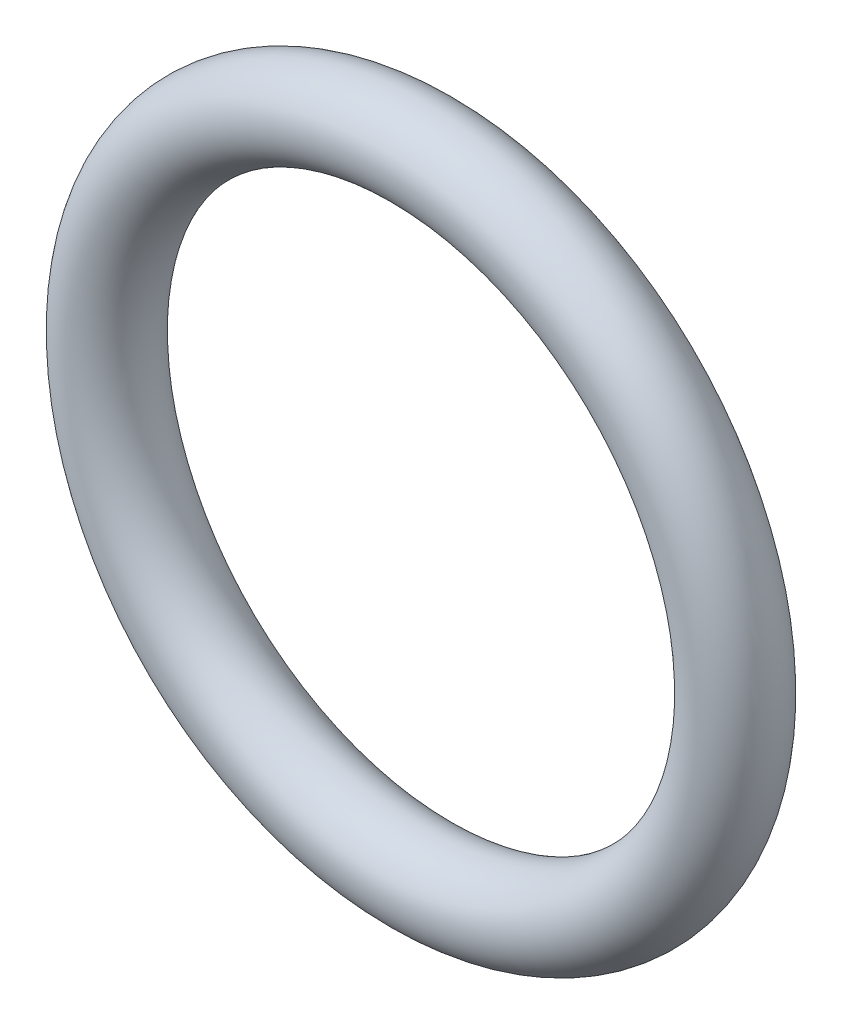
ISO-10303-21;
HEADER;
FILE_DESCRIPTION(('STEP AP214'),'2;1');
FILE_NAME('part.step','',(''),(''),'','','');
FILE_SCHEMA(('AUTOMOTIVE_DESIGN { 1 0 10303 214 1 1 1 1 }'));
ENDSEC;
DATA;
#1=APPLICATION_CONTEXT('core data for automotive mechanical design processes');
#2=APPLICATION_PROTOCOL_DEFINITION('international standard','automotive_design',2000,#1);
#3=PRODUCT_CONTEXT('',#1,'mechanical');
#4=PRODUCT('Part','Part','',(#3));
#5=PRODUCT_RELATED_PRODUCT_CATEGORY('part','',(#4));
#6=PRODUCT_DEFINITION_FORMATION('','',#4);
#7=PRODUCT_DEFINITION_CONTEXT('part definition',#1,'design');
#8=PRODUCT_DEFINITION('design','',#6,#7);
#9=PRODUCT_DEFINITION_SHAPE('','',#8);
#10=(LENGTH_UNIT() NAMED_UNIT(*) SI_UNIT(.MILLI.,.METRE.));
#11=(NAMED_UNIT(*) PLANE_ANGLE_UNIT() SI_UNIT($,.RADIAN.));
#12=(NAMED_UNIT(*) SI_UNIT($,.STERADIAN.) SOLID_ANGLE_UNIT());
#13=UNCERTAINTY_MEASURE_WITH_UNIT(LENGTH_MEASURE(1.E-05),#10,'distance_accuracy_value','');
#14=(GEOMETRIC_REPRESENTATION_CONTEXT(3) GLOBAL_UNCERTAINTY_ASSIGNED_CONTEXT((#13)) GLOBAL_UNIT_ASSIGNED_CONTEXT((#10,
#11,#12)) REPRESENTATION_CONTEXT('',''));
#15=CARTESIAN_POINT('',(0.,0.,0.));
#16=DIRECTION('',(0.,0.,1.));
#17=DIRECTION('',(1.,0.,0.));
#18=AXIS2_PLACEMENT_3D('',#15,#16,#17);
#19=CARTESIAN_POINT('',(0.,0.,0.));
#20=DIRECTION('',(0.,0.,1.));
#21=DIRECTION('',(1.,0.,0.));
#22=AXIS2_PLACEMENT_3D('',#19,#20,#21);
#23=TOROIDAL_SURFACE('',#22,17.4625,2.38125);
#24=CARTESIAN_POINT('',(0.,17.4625,0.));
#25=DIRECTION('',(1.,0.,0.));
#26=DIRECTION('',(0.,0.,-1.));
#27=AXIS2_PLACEMENT_3D('',#24,#25,#26);
#28=CIRCLE('',#27,2.38125);
#29=CARTESIAN_POINT('',(0.,19.84375,0.));
#30=VERTEX_POINT('',#29);
#31=EDGE_CURVE('E10',#30,#30,#28,.T.);
#32=CARTESIAN_POINT('',(0.,0.,0.));
#33=DIRECTION('',(0.,0.,1.));
#34=DIRECTION('',(1.,0.,0.));
#35=AXIS2_PLACEMENT_3D('',#32,#33,#34);
#36=CIRCLE('',#35,19.84375);
#37=EDGE_CURVE('',#30,#30,#36,.T.);
#38=ORIENTED_EDGE('',*,*,#31,.F.);
#39=ORIENTED_EDGE('',*,*,#31,.T.);
#40=ORIENTED_EDGE('',*,*,#37,.T.);
#41=ORIENTED_EDGE('',*,*,#37,.F.);
#42=EDGE_LOOP('',(#38,#40,#39,#41));
#43=FACE_BOUND('',#42,.T.);
#44=ADVANCED_FACE('F28',(#43),#23,.T.);
#45=CLOSED_SHELL('',(#44));
#46=MANIFOLD_SOLID_BREP('B2',#45);
#47=ADVANCED_BREP_SHAPE_REPRESENTATION('',(#18,#46),#14);
#48=SHAPE_DEFINITION_REPRESENTATION(#9,#47);
ENDSEC;
END-ISO-10303-21;
